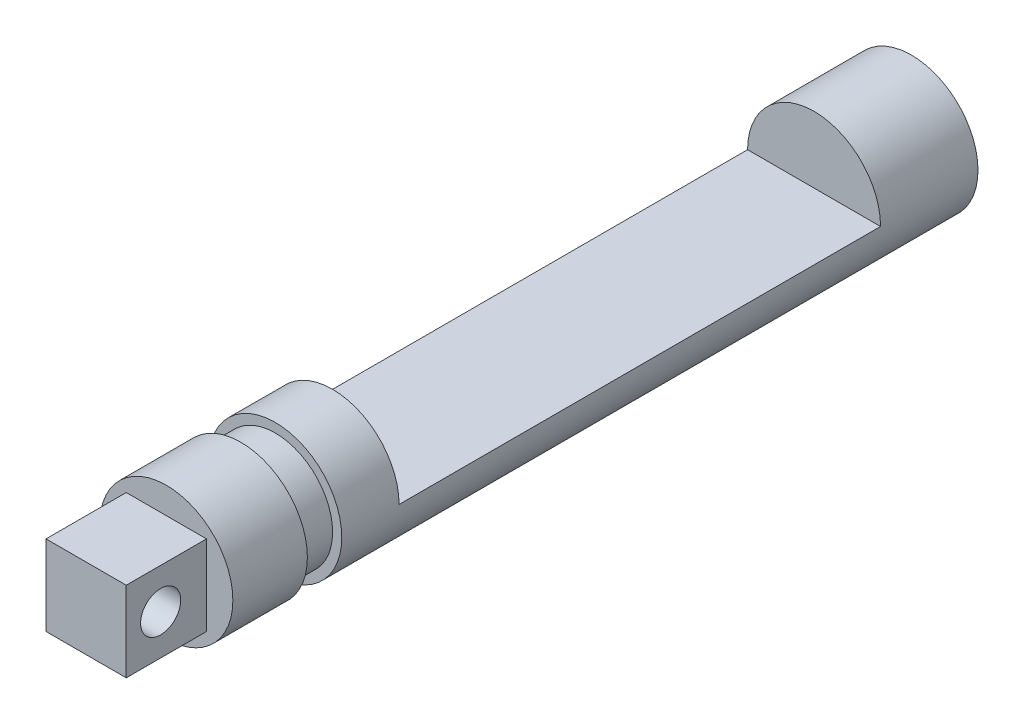
ISO-10303-21;
HEADER;
FILE_DESCRIPTION(('STEP AP214'),'2;1');
FILE_NAME('part.step','',(''),(''),'','','');
FILE_SCHEMA(('AUTOMOTIVE_DESIGN { 1 0 10303 214 1 1 1 1 }'));
ENDSEC;
DATA;
#1=APPLICATION_CONTEXT('core data for automotive mechanical design processes');
#2=APPLICATION_PROTOCOL_DEFINITION('international standard','automotive_design',2000,#1);
#3=PRODUCT_CONTEXT('',#1,'mechanical');
#4=PRODUCT('Part','Part','',(#3));
#5=PRODUCT_RELATED_PRODUCT_CATEGORY('part','',(#4));
#6=PRODUCT_DEFINITION_FORMATION('','',#4);
#7=PRODUCT_DEFINITION_CONTEXT('part definition',#1,'design');
#8=PRODUCT_DEFINITION('design','',#6,#7);
#9=PRODUCT_DEFINITION_SHAPE('','',#8);
#10=(LENGTH_UNIT() NAMED_UNIT(*) SI_UNIT(.MILLI.,.METRE.));
#11=(NAMED_UNIT(*) PLANE_ANGLE_UNIT() SI_UNIT($,.RADIAN.));
#12=(NAMED_UNIT(*) SI_UNIT($,.STERADIAN.) SOLID_ANGLE_UNIT());
#13=UNCERTAINTY_MEASURE_WITH_UNIT(LENGTH_MEASURE(1.E-05),#10,'distance_accuracy_value','');
#14=(GEOMETRIC_REPRESENTATION_CONTEXT(3) GLOBAL_UNCERTAINTY_ASSIGNED_CONTEXT((#13)) GLOBAL_UNIT_ASSIGNED_CONTEXT((#10,
#11,#12)) REPRESENTATION_CONTEXT('',''));
#15=CARTESIAN_POINT('',(0.,0.,0.));
#16=DIRECTION('',(0.,0.,1.));
#17=DIRECTION('',(1.,0.,0.));
#18=AXIS2_PLACEMENT_3D('',#15,#16,#17);
#19=CARTESIAN_POINT('',(0.,0.,32.5));
#20=DIRECTION('',(0.,0.,-1.));
#21=DIRECTION('',(-1.,0.,0.));
#22=AXIS2_PLACEMENT_3D('',#19,#20,#21);
#23=CYLINDRICAL_SURFACE('',#22,5.8);
#24=CARTESIAN_POINT('',(0.,0.,23.));
#25=DIRECTION('',(0.,0.,1.));
#26=DIRECTION('',(1.,0.,0.));
#27=AXIS2_PLACEMENT_3D('',#24,#25,#26);
#28=CIRCLE('',#27,5.8);
#29=CARTESIAN_POINT('',(5.8,0.,23.));
#30=VERTEX_POINT('',#29);
#31=EDGE_CURVE('E151',#30,#30,#28,.T.);
#32=ORIENTED_EDGE('',*,*,#31,.F.);
#33=EDGE_LOOP('',(#32));
#34=FACE_BOUND('',#33,.T.);
#35=CARTESIAN_POINT('',(0.,0.,-32.5));
#36=DIRECTION('',(0.,0.,1.));
#37=DIRECTION('',(1.,0.,0.));
#38=AXIS2_PLACEMENT_3D('',#35,#36,#37);
#39=CIRCLE('',#38,5.8);
#40=CARTESIAN_POINT('',(5.8,0.,-32.5));
#41=VERTEX_POINT('',#40);
#42=EDGE_CURVE('E44',#41,#41,#39,.T.);
#43=ORIENTED_EDGE('',*,*,#42,.T.);
#44=EDGE_LOOP('',(#43));
#45=FACE_BOUND('',#44,.T.);
#46=DIRECTION('',(0.,0.,1.));
#47=VECTOR('',#46,1.);
#48=CARTESIAN_POINT('',(5.8,0.,-24.));
#49=LINE('',#48,#47);
#50=CARTESIAN_POINT('',(5.8,0.,-24.));
#51=VERTEX_POINT('',#50);
#52=CARTESIAN_POINT('',(5.8,0.,18.));
#53=VERTEX_POINT('',#52);
#54=EDGE_CURVE('E102',#51,#53,#49,.T.);
#55=ORIENTED_EDGE('',*,*,#54,.T.);
#56=CARTESIAN_POINT('',(0.,0.,18.));
#57=DIRECTION('',(0.,0.,1.));
#58=DIRECTION('',(1.,0.,0.));
#59=AXIS2_PLACEMENT_3D('',#56,#57,#58);
#60=CIRCLE('',#59,5.8);
#61=CARTESIAN_POINT('',(-5.8,0.,18.));
#62=VERTEX_POINT('',#61);
#63=EDGE_CURVE('E106',#53,#62,#60,.T.);
#64=ORIENTED_EDGE('',*,*,#63,.T.);
#65=DIRECTION('',(0.,0.,1.));
#66=VECTOR('',#65,1.);
#67=CARTESIAN_POINT('',(-5.8,0.,-24.));
#68=LINE('',#67,#66);
#69=CARTESIAN_POINT('',(-5.8,0.,-24.));
#70=VERTEX_POINT('',#69);
#71=EDGE_CURVE('E92',#70,#62,#68,.T.);
#72=ORIENTED_EDGE('',*,*,#71,.F.);
#73=CARTESIAN_POINT('',(0.,0.,-24.));
#74=DIRECTION('',(0.,0.,1.));
#75=DIRECTION('',(1.,0.,0.));
#76=AXIS2_PLACEMENT_3D('',#73,#74,#75);
#77=CIRCLE('',#76,5.8);
#78=EDGE_CURVE('E154',#51,#70,#77,.T.);
#79=ORIENTED_EDGE('',*,*,#78,.F.);
#80=EDGE_LOOP('',(#55,#64,#72,#79));
#81=FACE_BOUND('',#80,.T.);
#82=ADVANCED_FACE('F40',(#34,#45,#81),#23,.T.);
#83=CARTESIAN_POINT('',(0.,0.,-32.5));
#84=DIRECTION('',(0.,0.,1.));
#85=DIRECTION('',(1.,0.,0.));
#86=AXIS2_PLACEMENT_3D('',#83,#84,#85);
#87=PLANE('',#86);
#88=ORIENTED_EDGE('',*,*,#42,.F.);
#89=EDGE_LOOP('',(#88));
#90=FACE_BOUND('',#89,.T.);
#91=ADVANCED_FACE('F163',(#90),#87,.F.);
#92=CARTESIAN_POINT('',(-5.8,0.,-24.));
#93=DIRECTION('',(0.,-1.,0.));
#94=DIRECTION('',(0.,0.,-1.));
#95=AXIS2_PLACEMENT_3D('',#92,#93,#94);
#96=PLANE('',#95);
#97=ORIENTED_EDGE('',*,*,#71,.T.);
#98=DIRECTION('',(1.,0.,0.));
#99=VECTOR('',#98,1.);
#100=CARTESIAN_POINT('',(-5.8,0.,18.));
#101=LINE('',#100,#99);
#102=EDGE_CURVE('E95',#62,#53,#101,.T.);
#103=ORIENTED_EDGE('',*,*,#102,.T.);
#104=ORIENTED_EDGE('',*,*,#54,.F.);
#105=DIRECTION('',(1.,0.,0.));
#106=VECTOR('',#105,1.);
#107=CARTESIAN_POINT('',(-5.8,0.,-24.));
#108=LINE('',#107,#106);
#109=EDGE_CURVE('E98',#70,#51,#108,.T.);
#110=ORIENTED_EDGE('',*,*,#109,.F.);
#111=EDGE_LOOP('',(#97,#103,#104,#110));
#112=FACE_BOUND('',#111,.T.);
#113=ADVANCED_FACE('F94',(#112),#96,.F.);
#114=CARTESIAN_POINT('',(0.,0.,-24.));
#115=DIRECTION('',(0.,0.,1.));
#116=DIRECTION('',(1.,0.,0.));
#117=AXIS2_PLACEMENT_3D('',#114,#115,#116);
#118=PLANE('',#117);
#119=ORIENTED_EDGE('',*,*,#78,.T.);
#120=ORIENTED_EDGE('',*,*,#109,.T.);
#121=EDGE_LOOP('',(#119,#120));
#122=FACE_BOUND('',#121,.T.);
#123=ADVANCED_FACE('F169',(#122),#118,.T.);
#124=CARTESIAN_POINT('',(0.,0.,23.));
#125=DIRECTION('',(0.,0.,1.));
#126=DIRECTION('',(1.,0.,0.));
#127=AXIS2_PLACEMENT_3D('',#124,#125,#126);
#128=PLANE('',#127);
#129=CARTESIAN_POINT('',(0.,0.,23.));
#130=DIRECTION('',(0.,0.,1.));
#131=DIRECTION('',(1.,0.,0.));
#132=AXIS2_PLACEMENT_3D('',#129,#130,#131);
#133=CIRCLE('',#132,5.);
#134=CARTESIAN_POINT('',(5.,0.,23.));
#135=VERTEX_POINT('',#134);
#136=EDGE_CURVE('E145',#135,#135,#133,.T.);
#137=ORIENTED_EDGE('',*,*,#136,.F.);
#138=EDGE_LOOP('',(#137));
#139=FACE_BOUND('',#138,.T.);
#140=ORIENTED_EDGE('',*,*,#31,.T.);
#141=EDGE_LOOP('',(#140));
#142=FACE_BOUND('',#141,.T.);
#143=ADVANCED_FACE('F179',(#139,#142),#128,.T.);
#144=CARTESIAN_POINT('',(0.,0.,26.));
#145=DIRECTION('',(0.,0.,1.));
#146=DIRECTION('',(1.,0.,0.));
#147=AXIS2_PLACEMENT_3D('',#144,#145,#146);
#148=PLANE('',#147);
#149=CARTESIAN_POINT('',(0.,0.,26.));
#150=DIRECTION('',(0.,0.,1.));
#151=DIRECTION('',(1.,0.,0.));
#152=AXIS2_PLACEMENT_3D('',#149,#150,#151);
#153=CIRCLE('',#152,5.);
#154=CARTESIAN_POINT('',(5.,0.,26.));
#155=VERTEX_POINT('',#154);
#156=EDGE_CURVE('E144',#155,#155,#153,.T.);
#157=ORIENTED_EDGE('',*,*,#156,.T.);
#158=EDGE_LOOP('',(#157));
#159=FACE_BOUND('',#158,.T.);
#160=CARTESIAN_POINT('',(0.,0.,26.));
#161=DIRECTION('',(0.,0.,1.));
#162=DIRECTION('',(1.,0.,0.));
#163=AXIS2_PLACEMENT_3D('',#160,#161,#162);
#164=CIRCLE('',#163,5.8);
#165=CARTESIAN_POINT('',(5.8,0.,26.));
#166=VERTEX_POINT('',#165);
#167=EDGE_CURVE('E148',#166,#166,#164,.T.);
#168=ORIENTED_EDGE('',*,*,#167,.F.);
#169=EDGE_LOOP('',(#168));
#170=FACE_BOUND('',#169,.T.);
#171=ADVANCED_FACE('F181',(#159,#170),#148,.F.);
#172=CARTESIAN_POINT('',(0.,0.,23.));
#173=DIRECTION('',(0.,0.,1.));
#174=DIRECTION('',(1.,0.,0.));
#175=AXIS2_PLACEMENT_3D('',#172,#173,#174);
#176=CYLINDRICAL_SURFACE('',#175,5.);
#177=ORIENTED_EDGE('',*,*,#136,.T.);
#178=EDGE_LOOP('',(#177));
#179=FACE_BOUND('',#178,.T.);
#180=ORIENTED_EDGE('',*,*,#156,.F.);
#181=EDGE_LOOP('',(#180));
#182=FACE_BOUND('',#181,.T.);
#183=ADVANCED_FACE('F175',(#179,#182),#176,.T.);
#184=CARTESIAN_POINT('',(0.,0.,32.5));
#185=DIRECTION('',(0.,0.,1.));
#186=DIRECTION('',(1.,0.,0.));
#187=AXIS2_PLACEMENT_3D('',#184,#185,#186);
#188=PLANE('',#187);
#189=DIRECTION('',(0.,1.,0.));
#190=VECTOR('',#189,1.);
#191=CARTESIAN_POINT('',(3.5,3.5,32.5));
#192=LINE('',#191,#190);
#193=CARTESIAN_POINT('',(3.5,-3.5,32.5));
#194=VERTEX_POINT('',#193);
#195=CARTESIAN_POINT('',(3.5,3.5,32.5));
#196=VERTEX_POINT('',#195);
#197=EDGE_CURVE('E55',#194,#196,#192,.T.);
#198=ORIENTED_EDGE('',*,*,#197,.F.);
#199=DIRECTION('',(1.,0.,0.));
#200=VECTOR('',#199,1.);
#201=CARTESIAN_POINT('',(-3.5,-3.5,32.5));
#202=LINE('',#201,#200);
#203=CARTESIAN_POINT('',(-3.5,-3.5,32.5));
#204=VERTEX_POINT('',#203);
#205=EDGE_CURVE('E59',#204,#194,#202,.T.);
#206=ORIENTED_EDGE('',*,*,#205,.F.);
#207=DIRECTION('',(0.,-1.,0.));
#208=VECTOR('',#207,1.);
#209=CARTESIAN_POINT('',(-3.5,3.5,32.5));
#210=LINE('',#209,#208);
#211=CARTESIAN_POINT('',(-3.5,3.5,32.5));
#212=VERTEX_POINT('',#211);
#213=EDGE_CURVE('E130',#212,#204,#210,.T.);
#214=ORIENTED_EDGE('',*,*,#213,.F.);
#215=DIRECTION('',(-1.,0.,0.));
#216=VECTOR('',#215,1.);
#217=CARTESIAN_POINT('',(-3.5,3.5,32.5));
#218=LINE('',#217,#216);
#219=EDGE_CURVE('E127',#196,#212,#218,.T.);
#220=ORIENTED_EDGE('',*,*,#219,.F.);
#221=EDGE_LOOP('',(#198,#206,#214,#220));
#222=FACE_BOUND('',#221,.T.);
#223=CARTESIAN_POINT('',(0.,0.,32.5));
#224=DIRECTION('',(0.,0.,1.));
#225=DIRECTION('',(1.,0.,0.));
#226=AXIS2_PLACEMENT_3D('',#223,#224,#225);
#227=CIRCLE('',#226,5.8);
#228=CARTESIAN_POINT('',(5.8,0.,32.5));
#229=VERTEX_POINT('',#228);
#230=EDGE_CURVE('E12',#229,#229,#227,.T.);
#231=ORIENTED_EDGE('',*,*,#230,.T.);
#232=EDGE_LOOP('',(#231));
#233=FACE_BOUND('',#232,.T.);
#234=ADVANCED_FACE('F173',(#222,#233),#188,.T.);
#235=ORIENTED_EDGE('',*,*,#167,.T.);
#236=EDGE_LOOP('',(#235));
#237=FACE_BOUND('',#236,.T.);
#238=ORIENTED_EDGE('',*,*,#230,.F.);
#239=EDGE_LOOP('',(#238));
#240=FACE_BOUND('',#239,.T.);
#241=ADVANCED_FACE('F42',(#237,#240),#23,.T.);
#242=CARTESIAN_POINT('',(3.5,3.5,39.5));
#243=DIRECTION('',(-1.,0.,0.));
#244=DIRECTION('',(0.,-1.,0.));
#245=AXIS2_PLACEMENT_3D('',#242,#243,#244);
#246=PLANE('',#245);
#247=CARTESIAN_POINT('',(3.5,0.,36.5));
#248=DIRECTION('',(-1.,0.,0.));
#249=DIRECTION('',(0.,-1.,0.));
#250=AXIS2_PLACEMENT_3D('',#247,#248,#249);
#251=CIRCLE('',#250,1.75);
#252=CARTESIAN_POINT('',(3.5,-1.75,36.5));
#253=VERTEX_POINT('',#252);
#254=EDGE_CURVE('E113',#253,#253,#251,.T.);
#255=ORIENTED_EDGE('',*,*,#254,.T.);
#256=EDGE_LOOP('',(#255));
#257=FACE_BOUND('',#256,.T.);
#258=ORIENTED_EDGE('',*,*,#197,.T.);
#259=DIRECTION('',(0.,0.,-1.));
#260=VECTOR('',#259,1.);
#261=CARTESIAN_POINT('',(3.5,3.5,39.5));
#262=LINE('',#261,#260);
#263=CARTESIAN_POINT('',(3.5,3.5,39.5));
#264=VERTEX_POINT('',#263);
#265=EDGE_CURVE('E141',#264,#196,#262,.T.);
#266=ORIENTED_EDGE('',*,*,#265,.F.);
#267=DIRECTION('',(0.,1.,0.));
#268=VECTOR('',#267,1.);
#269=CARTESIAN_POINT('',(3.5,3.5,39.5));
#270=LINE('',#269,#268);
#271=CARTESIAN_POINT('',(3.5,-3.5,39.5));
#272=VERTEX_POINT('',#271);
#273=EDGE_CURVE('E116',#272,#264,#270,.T.);
#274=ORIENTED_EDGE('',*,*,#273,.F.);
#275=DIRECTION('',(0.,0.,-1.));
#276=VECTOR('',#275,1.);
#277=CARTESIAN_POINT('',(3.5,-3.5,39.5));
#278=LINE('',#277,#276);
#279=EDGE_CURVE('E125',#272,#194,#278,.T.);
#280=ORIENTED_EDGE('',*,*,#279,.T.);
#281=EDGE_LOOP('',(#258,#266,#274,#280));
#282=FACE_BOUND('',#281,.T.);
#283=ADVANCED_FACE('F191',(#257,#282),#246,.F.);
#284=CARTESIAN_POINT('',(-3.5,3.5,39.5));
#285=DIRECTION('',(0.,-1.,0.));
#286=DIRECTION('',(0.,0.,-1.));
#287=AXIS2_PLACEMENT_3D('',#284,#285,#286);
#288=PLANE('',#287);
#289=ORIENTED_EDGE('',*,*,#219,.T.);
#290=DIRECTION('',(0.,0.,-1.));
#291=VECTOR('',#290,1.);
#292=CARTESIAN_POINT('',(-3.5,3.5,39.5));
#293=LINE('',#292,#291);
#294=CARTESIAN_POINT('',(-3.5,3.5,39.5));
#295=VERTEX_POINT('',#294);
#296=EDGE_CURVE('E138',#295,#212,#293,.T.);
#297=ORIENTED_EDGE('',*,*,#296,.F.);
#298=DIRECTION('',(-1.,0.,0.));
#299=VECTOR('',#298,1.);
#300=CARTESIAN_POINT('',(-3.5,3.5,39.5));
#301=LINE('',#300,#299);
#302=EDGE_CURVE('E119',#264,#295,#301,.T.);
#303=ORIENTED_EDGE('',*,*,#302,.F.);
#304=ORIENTED_EDGE('',*,*,#265,.T.);
#305=EDGE_LOOP('',(#289,#297,#303,#304));
#306=FACE_BOUND('',#305,.T.);
#307=ADVANCED_FACE('F194',(#306),#288,.F.);
#308=CARTESIAN_POINT('',(-3.5,3.5,39.5));
#309=DIRECTION('',(1.,0.,0.));
#310=DIRECTION('',(0.,1.,0.));
#311=AXIS2_PLACEMENT_3D('',#308,#309,#310);
#312=PLANE('',#311);
#313=CARTESIAN_POINT('',(-3.5,0.,36.5));
#314=DIRECTION('',(-1.,0.,0.));
#315=DIRECTION('',(0.,-1.,0.));
#316=AXIS2_PLACEMENT_3D('',#313,#314,#315);
#317=CIRCLE('',#316,1.75);
#318=CARTESIAN_POINT('',(-3.5,-1.75,36.5));
#319=VERTEX_POINT('',#318);
#320=EDGE_CURVE('E107',#319,#319,#317,.T.);
#321=ORIENTED_EDGE('',*,*,#320,.F.);
#322=EDGE_LOOP('',(#321));
#323=FACE_BOUND('',#322,.T.);
#324=ORIENTED_EDGE('',*,*,#213,.T.);
#325=DIRECTION('',(0.,0.,-1.));
#326=VECTOR('',#325,1.);
#327=CARTESIAN_POINT('',(-3.5,-3.5,39.5));
#328=LINE('',#327,#326);
#329=CARTESIAN_POINT('',(-3.5,-3.5,39.5));
#330=VERTEX_POINT('',#329);
#331=EDGE_CURVE('E135',#330,#204,#328,.T.);
#332=ORIENTED_EDGE('',*,*,#331,.F.);
#333=DIRECTION('',(0.,-1.,0.));
#334=VECTOR('',#333,1.);
#335=CARTESIAN_POINT('',(-3.5,3.5,39.5));
#336=LINE('',#335,#334);
#337=EDGE_CURVE('E121',#295,#330,#336,.T.);
#338=ORIENTED_EDGE('',*,*,#337,.F.);
#339=ORIENTED_EDGE('',*,*,#296,.T.);
#340=EDGE_LOOP('',(#324,#332,#338,#339));
#341=FACE_BOUND('',#340,.T.);
#342=ADVANCED_FACE('F198',(#323,#341),#312,.F.);
#343=CARTESIAN_POINT('',(-3.5,-3.5,39.5));
#344=DIRECTION('',(0.,1.,0.));
#345=DIRECTION('',(0.,0.,1.));
#346=AXIS2_PLACEMENT_3D('',#343,#344,#345);
#347=PLANE('',#346);
#348=ORIENTED_EDGE('',*,*,#205,.T.);
#349=ORIENTED_EDGE('',*,*,#279,.F.);
#350=DIRECTION('',(1.,0.,0.));
#351=VECTOR('',#350,1.);
#352=CARTESIAN_POINT('',(-3.5,-3.5,39.5));
#353=LINE('',#352,#351);
#354=EDGE_CURVE('E123',#330,#272,#353,.T.);
#355=ORIENTED_EDGE('',*,*,#354,.F.);
#356=ORIENTED_EDGE('',*,*,#331,.T.);
#357=EDGE_LOOP('',(#348,#349,#355,#356));
#358=FACE_BOUND('',#357,.T.);
#359=ADVANCED_FACE('F202',(#358),#347,.F.);
#360=CARTESIAN_POINT('',(0.,0.,39.5));
#361=DIRECTION('',(0.,0.,1.));
#362=DIRECTION('',(1.,0.,0.));
#363=AXIS2_PLACEMENT_3D('',#360,#361,#362);
#364=PLANE('',#363);
#365=ORIENTED_EDGE('',*,*,#273,.T.);
#366=ORIENTED_EDGE('',*,*,#302,.T.);
#367=ORIENTED_EDGE('',*,*,#337,.T.);
#368=ORIENTED_EDGE('',*,*,#354,.T.);
#369=EDGE_LOOP('',(#365,#366,#367,#368));
#370=FACE_BOUND('',#369,.T.);
#371=ADVANCED_FACE('F206',(#370),#364,.T.);
#372=CARTESIAN_POINT('',(5.8,0.,36.5));
#373=DIRECTION('',(-1.,0.,0.));
#374=DIRECTION('',(0.,-1.,0.));
#375=AXIS2_PLACEMENT_3D('',#372,#373,#374);
#376=CYLINDRICAL_SURFACE('',#375,1.75);
#377=ORIENTED_EDGE('',*,*,#320,.T.);
#378=EDGE_LOOP('',(#377));
#379=FACE_BOUND('',#378,.T.);
#380=ORIENTED_EDGE('',*,*,#254,.F.);
#381=EDGE_LOOP('',(#380));
#382=FACE_BOUND('',#381,.T.);
#383=ADVANCED_FACE('F210',(#379,#382),#376,.F.);
#384=CARTESIAN_POINT('',(0.,0.,18.));
#385=DIRECTION('',(0.,0.,1.));
#386=DIRECTION('',(1.,0.,0.));
#387=AXIS2_PLACEMENT_3D('',#384,#385,#386);
#388=PLANE('',#387);
#389=ORIENTED_EDGE('',*,*,#63,.F.);
#390=ORIENTED_EDGE('',*,*,#102,.F.);
#391=EDGE_LOOP('',(#389,#390));
#392=FACE_BOUND('',#391,.T.);
#393=ADVANCED_FACE('F105',(#392),#388,.F.);
#394=CLOSED_SHELL('',(#82,#91,#113,#123,#143,#171,#183,#234,#241,#283,#307,#342,#359,#371,#383,#393));
#395=MANIFOLD_SOLID_BREP('B2',#394);
#396=ADVANCED_BREP_SHAPE_REPRESENTATION('',(#18,#395),#14);
#397=SHAPE_DEFINITION_REPRESENTATION(#9,#396);
ENDSEC;
END-ISO-10303-21;
